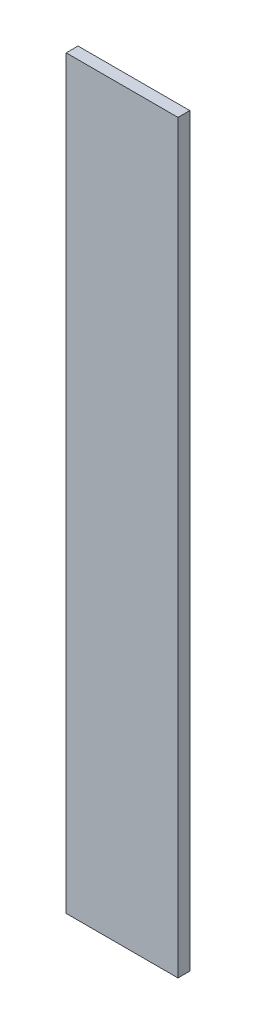
ISO-10303-21;
HEADER;
FILE_DESCRIPTION(('STEP AP214'),'2;1');
FILE_NAME('part.step','',(''),(''),'','','');
FILE_SCHEMA(('AUTOMOTIVE_DESIGN { 1 0 10303 214 1 1 1 1 }'));
ENDSEC;
DATA;
#1=APPLICATION_CONTEXT('core data for automotive mechanical design processes');
#2=APPLICATION_PROTOCOL_DEFINITION('international standard','automotive_design',2000,#1);
#3=PRODUCT_CONTEXT('',#1,'mechanical');
#4=PRODUCT('Part','Part','',(#3));
#5=PRODUCT_RELATED_PRODUCT_CATEGORY('part','',(#4));
#6=PRODUCT_DEFINITION_FORMATION('','',#4);
#7=PRODUCT_DEFINITION_CONTEXT('part definition',#1,'design');
#8=PRODUCT_DEFINITION('design','',#6,#7);
#9=PRODUCT_DEFINITION_SHAPE('','',#8);
#10=(LENGTH_UNIT() NAMED_UNIT(*) SI_UNIT(.MILLI.,.METRE.));
#11=(NAMED_UNIT(*) PLANE_ANGLE_UNIT() SI_UNIT($,.RADIAN.));
#12=(NAMED_UNIT(*) SI_UNIT($,.STERADIAN.) SOLID_ANGLE_UNIT());
#13=UNCERTAINTY_MEASURE_WITH_UNIT(LENGTH_MEASURE(1.E-05),#10,'distance_accuracy_value','');
#14=(GEOMETRIC_REPRESENTATION_CONTEXT(3) GLOBAL_UNCERTAINTY_ASSIGNED_CONTEXT((#13)) GLOBAL_UNIT_ASSIGNED_CONTEXT((#10,
#11,#12)) REPRESENTATION_CONTEXT('',''));
#15=CARTESIAN_POINT('',(0.,0.,0.));
#16=DIRECTION('',(0.,0.,1.));
#17=DIRECTION('',(1.,0.,0.));
#18=AXIS2_PLACEMENT_3D('',#15,#16,#17);
#19=CARTESIAN_POINT('',(-15.,-100.,3.175));
#20=DIRECTION('',(1.,0.,0.));
#21=DIRECTION('',(0.,0.,-1.));
#22=AXIS2_PLACEMENT_3D('',#19,#20,#21);
#23=PLANE('',#22);
#24=DIRECTION('',(0.,-1.,0.));
#25=VECTOR('',#24,1.);
#26=CARTESIAN_POINT('',(-15.,-100.,0.));
#27=LINE('',#26,#25);
#28=CARTESIAN_POINT('',(-15.,99.9999999999999,0.));
#29=VERTEX_POINT('',#28);
#30=CARTESIAN_POINT('',(-15.,-100.,0.));
#31=VERTEX_POINT('',#30);
#32=EDGE_CURVE('E96',#29,#31,#27,.T.);
#33=ORIENTED_EDGE('',*,*,#32,.T.);
#34=DIRECTION('',(0.,0.,-1.));
#35=VECTOR('',#34,1.);
#36=CARTESIAN_POINT('',(-15.,-100.,3.175));
#37=LINE('',#36,#35);
#38=CARTESIAN_POINT('',(-15.,-100.,3.175));
#39=VERTEX_POINT('',#38);
#40=EDGE_CURVE('E11',#39,#31,#37,.T.);
#41=ORIENTED_EDGE('',*,*,#40,.F.);
#42=DIRECTION('',(0.,-1.,0.));
#43=VECTOR('',#42,1.);
#44=CARTESIAN_POINT('',(-15.,-100.,3.175));
#45=LINE('',#44,#43);
#46=CARTESIAN_POINT('',(-15.,99.9999999999999,3.175));
#47=VERTEX_POINT('',#46);
#48=EDGE_CURVE('E84',#47,#39,#45,.T.);
#49=ORIENTED_EDGE('',*,*,#48,.F.);
#50=DIRECTION('',(0.,0.,-1.));
#51=VECTOR('',#50,1.);
#52=CARTESIAN_POINT('',(-15.,99.9999999999999,3.175));
#53=LINE('',#52,#51);
#54=EDGE_CURVE('E92',#47,#29,#53,.T.);
#55=ORIENTED_EDGE('',*,*,#54,.T.);
#56=EDGE_LOOP('',(#33,#41,#49,#55));
#57=FACE_BOUND('',#56,.T.);
#58=ADVANCED_FACE('F33',(#57),#23,.F.);
#59=CARTESIAN_POINT('',(15.,-100.,3.175));
#60=DIRECTION('',(0.,1.,0.));
#61=DIRECTION('',(-1.,0.,0.));
#62=AXIS2_PLACEMENT_3D('',#59,#60,#61);
#63=PLANE('',#62);
#64=DIRECTION('',(1.,0.,0.));
#65=VECTOR('',#64,1.);
#66=CARTESIAN_POINT('',(15.,-100.,0.));
#67=LINE('',#66,#65);
#68=CARTESIAN_POINT('',(15.,-100.,0.));
#69=VERTEX_POINT('',#68);
#70=EDGE_CURVE('E88',#31,#69,#67,.T.);
#71=ORIENTED_EDGE('',*,*,#70,.T.);
#72=DIRECTION('',(0.,0.,-1.));
#73=VECTOR('',#72,1.);
#74=CARTESIAN_POINT('',(15.,-100.,3.175));
#75=LINE('',#74,#73);
#76=CARTESIAN_POINT('',(15.,-100.,3.175));
#77=VERTEX_POINT('',#76);
#78=EDGE_CURVE('E41',#77,#69,#75,.T.);
#79=ORIENTED_EDGE('',*,*,#78,.F.);
#80=DIRECTION('',(1.,0.,0.));
#81=VECTOR('',#80,1.);
#82=CARTESIAN_POINT('',(15.,-100.,3.175));
#83=LINE('',#82,#81);
#84=EDGE_CURVE('E79',#39,#77,#83,.T.);
#85=ORIENTED_EDGE('',*,*,#84,.F.);
#86=ORIENTED_EDGE('',*,*,#40,.T.);
#87=EDGE_LOOP('',(#71,#79,#85,#86));
#88=FACE_BOUND('',#87,.T.);
#89=ADVANCED_FACE('F87',(#88),#63,.F.);
#90=CARTESIAN_POINT('',(15.,-100.,3.175));
#91=DIRECTION('',(-1.,0.,0.));
#92=DIRECTION('',(0.,0.,1.));
#93=AXIS2_PLACEMENT_3D('',#90,#91,#92);
#94=PLANE('',#93);
#95=DIRECTION('',(0.,1.,0.));
#96=VECTOR('',#95,1.);
#97=CARTESIAN_POINT('',(15.,-100.,0.));
#98=LINE('',#97,#96);
#99=CARTESIAN_POINT('',(15.,99.9999999999999,0.));
#100=VERTEX_POINT('',#99);
#101=EDGE_CURVE('E66',#69,#100,#98,.T.);
#102=ORIENTED_EDGE('',*,*,#101,.T.);
#103=DIRECTION('',(0.,0.,-1.));
#104=VECTOR('',#103,1.);
#105=CARTESIAN_POINT('',(15.,99.9999999999999,3.175));
#106=LINE('',#105,#104);
#107=CARTESIAN_POINT('',(15.,99.9999999999999,3.175));
#108=VERTEX_POINT('',#107);
#109=EDGE_CURVE('E89',#108,#100,#106,.T.);
#110=ORIENTED_EDGE('',*,*,#109,.F.);
#111=DIRECTION('',(0.,1.,0.));
#112=VECTOR('',#111,1.);
#113=CARTESIAN_POINT('',(15.,-100.,3.175));
#114=LINE('',#113,#112);
#115=EDGE_CURVE('E82',#77,#108,#114,.T.);
#116=ORIENTED_EDGE('',*,*,#115,.F.);
#117=ORIENTED_EDGE('',*,*,#78,.T.);
#118=EDGE_LOOP('',(#102,#110,#116,#117));
#119=FACE_BOUND('',#118,.T.);
#120=ADVANCED_FACE('F90',(#119),#94,.F.);
#121=CARTESIAN_POINT('',(15.,99.9999999999999,3.175));
#122=DIRECTION('',(0.,-1.,0.));
#123=DIRECTION('',(1.,0.,0.));
#124=AXIS2_PLACEMENT_3D('',#121,#122,#123);
#125=PLANE('',#124);
#126=DIRECTION('',(-1.,0.,0.));
#127=VECTOR('',#126,1.);
#128=CARTESIAN_POINT('',(15.,99.9999999999999,0.));
#129=LINE('',#128,#127);
#130=EDGE_CURVE('E72',#100,#29,#129,.T.);
#131=ORIENTED_EDGE('',*,*,#130,.T.);
#132=ORIENTED_EDGE('',*,*,#54,.F.);
#133=DIRECTION('',(-1.,0.,0.));
#134=VECTOR('',#133,1.);
#135=CARTESIAN_POINT('',(15.,99.9999999999999,3.175));
#136=LINE('',#135,#134);
#137=EDGE_CURVE('E49',#108,#47,#136,.T.);
#138=ORIENTED_EDGE('',*,*,#137,.F.);
#139=ORIENTED_EDGE('',*,*,#109,.T.);
#140=EDGE_LOOP('',(#131,#132,#138,#139));
#141=FACE_BOUND('',#140,.T.);
#142=ADVANCED_FACE('F103',(#141),#125,.F.);
#143=CARTESIAN_POINT('',(0.,0.,3.175));
#144=DIRECTION('',(0.,0.,1.));
#145=DIRECTION('',(1.,0.,0.));
#146=AXIS2_PLACEMENT_3D('',#143,#144,#145);
#147=PLANE('',#146);
#148=ORIENTED_EDGE('',*,*,#48,.T.);
#149=ORIENTED_EDGE('',*,*,#84,.T.);
#150=ORIENTED_EDGE('',*,*,#115,.T.);
#151=ORIENTED_EDGE('',*,*,#137,.T.);
#152=EDGE_LOOP('',(#148,#149,#150,#151));
#153=FACE_BOUND('',#152,.T.);
#154=ADVANCED_FACE('F80',(#153),#147,.T.);
#155=CARTESIAN_POINT('',(0.,0.,0.));
#156=DIRECTION('',(0.,0.,1.));
#157=DIRECTION('',(1.,0.,0.));
#158=AXIS2_PLACEMENT_3D('',#155,#156,#157);
#159=PLANE('',#158);
#160=ORIENTED_EDGE('',*,*,#32,.F.);
#161=ORIENTED_EDGE('',*,*,#130,.F.);
#162=ORIENTED_EDGE('',*,*,#101,.F.);
#163=ORIENTED_EDGE('',*,*,#70,.F.);
#164=EDGE_LOOP('',(#160,#161,#162,#163));
#165=FACE_BOUND('',#164,.T.);
#166=ADVANCED_FACE('F106',(#165),#159,.F.);
#167=CLOSED_SHELL('',(#58,#89,#120,#142,#154,#166));
#168=MANIFOLD_SOLID_BREP('B2',#167);
#169=ADVANCED_BREP_SHAPE_REPRESENTATION('',(#18,#168),#14);
#170=SHAPE_DEFINITION_REPRESENTATION(#9,#169);
ENDSEC;
END-ISO-10303-21;
